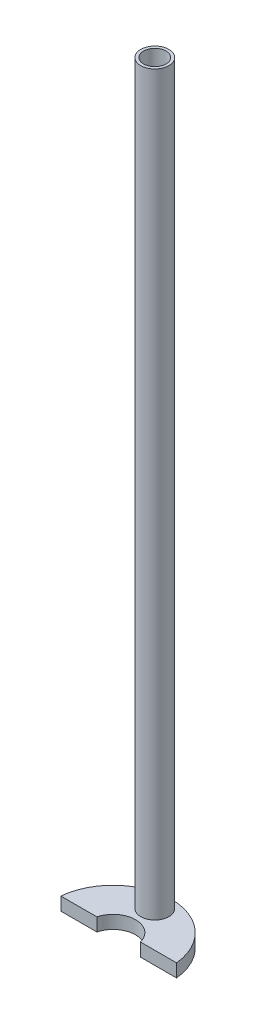
ISO-10303-21;
HEADER;
FILE_DESCRIPTION(('STEP AP214'),'2;1');
FILE_NAME('part.step','',(''),(''),'','','');
FILE_SCHEMA(('AUTOMOTIVE_DESIGN { 1 0 10303 214 1 1 1 1 }'));
ENDSEC;
DATA;
#1=APPLICATION_CONTEXT('core data for automotive mechanical design processes');
#2=APPLICATION_PROTOCOL_DEFINITION('international standard','automotive_design',2000,#1);
#3=PRODUCT_CONTEXT('',#1,'mechanical');
#4=PRODUCT('Part','Part','',(#3));
#5=PRODUCT_RELATED_PRODUCT_CATEGORY('part','',(#4));
#6=PRODUCT_DEFINITION_FORMATION('','',#4);
#7=PRODUCT_DEFINITION_CONTEXT('part definition',#1,'design');
#8=PRODUCT_DEFINITION('design','',#6,#7);
#9=PRODUCT_DEFINITION_SHAPE('','',#8);
#10=(LENGTH_UNIT() NAMED_UNIT(*) SI_UNIT(.MILLI.,.METRE.));
#11=(NAMED_UNIT(*) PLANE_ANGLE_UNIT() SI_UNIT($,.RADIAN.));
#12=(NAMED_UNIT(*) SI_UNIT($,.STERADIAN.) SOLID_ANGLE_UNIT());
#13=UNCERTAINTY_MEASURE_WITH_UNIT(LENGTH_MEASURE(1.E-05),#10,'distance_accuracy_value','');
#14=(GEOMETRIC_REPRESENTATION_CONTEXT(3) GLOBAL_UNCERTAINTY_ASSIGNED_CONTEXT((#13)) GLOBAL_UNIT_ASSIGNED_CONTEXT((#10,
#11,#12)) REPRESENTATION_CONTEXT('',''));
#15=CARTESIAN_POINT('',(0.,0.,0.));
#16=DIRECTION('',(0.,0.,1.));
#17=DIRECTION('',(1.,0.,0.));
#18=AXIS2_PLACEMENT_3D('',#15,#16,#17);
#19=CARTESIAN_POINT('',(0.,3.5,0.));
#20=DIRECTION('',(0.,-1.,0.));
#21=DIRECTION('',(0.,0.,-1.));
#22=AXIS2_PLACEMENT_3D('',#19,#20,#21);
#23=CYLINDRICAL_SURFACE('',#22,6.);
#24=CARTESIAN_POINT('',(0.,0.,0.));
#25=DIRECTION('',(0.,1.,0.));
#26=DIRECTION('',(0.,0.,1.));
#27=AXIS2_PLACEMENT_3D('',#24,#25,#26);
#28=CIRCLE('',#27,6.);
#29=CARTESIAN_POINT('',(5.80947501931112,0.,-1.5));
#30=VERTEX_POINT('',#29);
#31=CARTESIAN_POINT('',(-5.80947501931112,0.,-1.5));
#32=VERTEX_POINT('',#31);
#33=EDGE_CURVE('E113',#30,#32,#28,.T.);
#34=ORIENTED_EDGE('',*,*,#33,.F.);
#35=DIRECTION('',(0.,-1.,0.));
#36=VECTOR('',#35,1.);
#37=CARTESIAN_POINT('',(5.80947501931112,3.5,-1.5));
#38=LINE('',#37,#36);
#39=CARTESIAN_POINT('',(5.80947501931112,3.5,-1.5));
#40=VERTEX_POINT('',#39);
#41=EDGE_CURVE('E11',#40,#30,#38,.T.);
#42=ORIENTED_EDGE('',*,*,#41,.F.);
#43=CARTESIAN_POINT('',(0.,3.5,0.));
#44=DIRECTION('',(0.,1.,0.));
#45=DIRECTION('',(0.,0.,1.));
#46=AXIS2_PLACEMENT_3D('',#43,#44,#45);
#47=CIRCLE('',#46,6.);
#48=CARTESIAN_POINT('',(-5.80947501931112,3.5,-1.5));
#49=VERTEX_POINT('',#48);
#50=EDGE_CURVE('E98',#40,#49,#47,.T.);
#51=ORIENTED_EDGE('',*,*,#50,.T.);
#52=DIRECTION('',(0.,-1.,0.));
#53=VECTOR('',#52,1.);
#54=CARTESIAN_POINT('',(-5.80947501931112,3.5,-1.5));
#55=LINE('',#54,#53);
#56=EDGE_CURVE('E87',#49,#32,#55,.T.);
#57=ORIENTED_EDGE('',*,*,#56,.T.);
#58=EDGE_LOOP('',(#34,#42,#51,#57));
#59=FACE_BOUND('',#58,.T.);
#60=ADVANCED_FACE('F47',(#59),#23,.F.);
#61=CARTESIAN_POINT('',(0.,3.5,-1.5));
#62=DIRECTION('',(0.,0.,-1.));
#63=DIRECTION('',(-1.,0.,0.));
#64=AXIS2_PLACEMENT_3D('',#61,#62,#63);
#65=PLANE('',#64);
#66=DIRECTION('',(1.,0.,0.));
#67=VECTOR('',#66,1.);
#68=CARTESIAN_POINT('',(0.,0.,-1.5));
#69=LINE('',#68,#67);
#70=CARTESIAN_POINT('',(15.4272486205415,0.,-1.5));
#71=VERTEX_POINT('',#70);
#72=EDGE_CURVE('E104',#30,#71,#69,.T.);
#73=ORIENTED_EDGE('',*,*,#72,.T.);
#74=DIRECTION('',(0.,-1.,0.));
#75=VECTOR('',#74,1.);
#76=CARTESIAN_POINT('',(15.4272486205415,3.5,-1.5));
#77=LINE('',#76,#75);
#78=CARTESIAN_POINT('',(15.4272486205415,3.5,-1.5));
#79=VERTEX_POINT('',#78);
#80=EDGE_CURVE('E56',#79,#71,#77,.T.);
#81=ORIENTED_EDGE('',*,*,#80,.F.);
#82=DIRECTION('',(1.,0.,0.));
#83=VECTOR('',#82,1.);
#84=CARTESIAN_POINT('',(0.,3.5,-1.5));
#85=LINE('',#84,#83);
#86=EDGE_CURVE('E93',#40,#79,#85,.T.);
#87=ORIENTED_EDGE('',*,*,#86,.F.);
#88=ORIENTED_EDGE('',*,*,#41,.T.);
#89=EDGE_LOOP('',(#73,#81,#87,#88));
#90=FACE_BOUND('',#89,.T.);
#91=ADVANCED_FACE('F102',(#90),#65,.F.);
#92=CARTESIAN_POINT('',(0.,3.5,0.));
#93=DIRECTION('',(0.,-1.,0.));
#94=DIRECTION('',(0.,0.,-1.));
#95=AXIS2_PLACEMENT_3D('',#92,#93,#94);
#96=CYLINDRICAL_SURFACE('',#95,15.5);
#97=CARTESIAN_POINT('',(0.,0.,0.));
#98=DIRECTION('',(0.,1.,0.));
#99=DIRECTION('',(0.,0.,1.));
#100=AXIS2_PLACEMENT_3D('',#97,#98,#99);
#101=CIRCLE('',#100,15.5);
#102=CARTESIAN_POINT('',(-15.4272486205415,0.,-1.5));
#103=VERTEX_POINT('',#102);
#104=EDGE_CURVE('E80',#71,#103,#101,.T.);
#105=ORIENTED_EDGE('',*,*,#104,.T.);
#106=DIRECTION('',(0.,-1.,0.));
#107=VECTOR('',#106,1.);
#108=CARTESIAN_POINT('',(-15.4272486205415,3.5,-1.5));
#109=LINE('',#108,#107);
#110=CARTESIAN_POINT('',(-15.4272486205415,3.5,-1.5));
#111=VERTEX_POINT('',#110);
#112=EDGE_CURVE('E106',#111,#103,#109,.T.);
#113=ORIENTED_EDGE('',*,*,#112,.F.);
#114=CARTESIAN_POINT('',(0.,3.5,0.));
#115=DIRECTION('',(0.,1.,0.));
#116=DIRECTION('',(0.,0.,1.));
#117=AXIS2_PLACEMENT_3D('',#114,#115,#116);
#118=CIRCLE('',#117,15.5);
#119=EDGE_CURVE('E97',#79,#111,#118,.T.);
#120=ORIENTED_EDGE('',*,*,#119,.F.);
#121=ORIENTED_EDGE('',*,*,#80,.T.);
#122=EDGE_LOOP('',(#105,#113,#120,#121));
#123=FACE_BOUND('',#122,.T.);
#124=ADVANCED_FACE('F107',(#123),#96,.T.);
#125=EDGE_CURVE('E120',#103,#32,#69,.T.);
#126=ORIENTED_EDGE('',*,*,#125,.T.);
#127=ORIENTED_EDGE('',*,*,#56,.F.);
#128=EDGE_CURVE('E64',#111,#49,#85,.T.);
#129=ORIENTED_EDGE('',*,*,#128,.F.);
#130=ORIENTED_EDGE('',*,*,#112,.T.);
#131=EDGE_LOOP('',(#126,#127,#129,#130));
#132=FACE_BOUND('',#131,.T.);
#133=ADVANCED_FACE('F128',(#132),#65,.F.);
#134=CARTESIAN_POINT('',(0.,3.5,0.));
#135=DIRECTION('',(0.,1.,0.));
#136=DIRECTION('',(0.,0.,1.));
#137=AXIS2_PLACEMENT_3D('',#134,#135,#136);
#138=PLANE('',#137);
#139=CARTESIAN_POINT('',(0.,3.5,-11.125));
#140=DIRECTION('',(0.,1.,0.));
#141=DIRECTION('',(0.,0.,1.));
#142=AXIS2_PLACEMENT_3D('',#139,#140,#141);
#143=CIRCLE('',#142,3.75);
#144=CARTESIAN_POINT('',(0.,3.5,-7.375));
#145=VERTEX_POINT('',#144);
#146=EDGE_CURVE('E117',#145,#145,#143,.F.);
#147=ORIENTED_EDGE('',*,*,#146,.T.);
#148=EDGE_LOOP('',(#147));
#149=FACE_BOUND('',#148,.T.);
#150=ORIENTED_EDGE('',*,*,#50,.F.);
#151=ORIENTED_EDGE('',*,*,#86,.T.);
#152=ORIENTED_EDGE('',*,*,#119,.T.);
#153=ORIENTED_EDGE('',*,*,#128,.T.);
#154=EDGE_LOOP('',(#150,#151,#152,#153));
#155=FACE_BOUND('',#154,.T.);
#156=ADVANCED_FACE('F95',(#149,#155),#138,.T.);
#157=CARTESIAN_POINT('',(0.,0.,0.));
#158=DIRECTION('',(0.,1.,0.));
#159=DIRECTION('',(0.,0.,1.));
#160=AXIS2_PLACEMENT_3D('',#157,#158,#159);
#161=PLANE('',#160);
#162=CARTESIAN_POINT('',(0.,0.,-11.125));
#163=DIRECTION('',(0.,1.,0.));
#164=DIRECTION('',(0.,0.,1.));
#165=AXIS2_PLACEMENT_3D('',#162,#163,#164);
#166=CIRCLE('',#165,3.);
#167=CARTESIAN_POINT('',(0.,0.,-8.125));
#168=VERTEX_POINT('',#167);
#169=EDGE_CURVE('E141',#168,#168,#166,.T.);
#170=ORIENTED_EDGE('',*,*,#169,.T.);
#171=EDGE_LOOP('',(#170));
#172=FACE_BOUND('',#171,.T.);
#173=ORIENTED_EDGE('',*,*,#33,.T.);
#174=ORIENTED_EDGE('',*,*,#125,.F.);
#175=ORIENTED_EDGE('',*,*,#104,.F.);
#176=ORIENTED_EDGE('',*,*,#72,.F.);
#177=EDGE_LOOP('',(#173,#174,#175,#176));
#178=FACE_BOUND('',#177,.T.);
#179=ADVANCED_FACE('F130',(#172,#178),#161,.F.);
#180=CARTESIAN_POINT('',(0.,200.,-11.125));
#181=DIRECTION('',(0.,-1.,0.));
#182=DIRECTION('',(0.,0.,-1.));
#183=AXIS2_PLACEMENT_3D('',#180,#181,#182);
#184=CYLINDRICAL_SURFACE('',#183,3.75);
#185=ORIENTED_EDGE('',*,*,#146,.F.);
#186=EDGE_LOOP('',(#185));
#187=FACE_BOUND('',#186,.T.);
#188=CARTESIAN_POINT('',(0.,200.,-11.125));
#189=DIRECTION('',(0.,1.,0.));
#190=DIRECTION('',(0.,0.,1.));
#191=AXIS2_PLACEMENT_3D('',#188,#189,#190);
#192=CIRCLE('',#191,3.75);
#193=CARTESIAN_POINT('',(0.,200.,-7.375));
#194=VERTEX_POINT('',#193);
#195=EDGE_CURVE('E137',#194,#194,#192,.T.);
#196=ORIENTED_EDGE('',*,*,#195,.F.);
#197=EDGE_LOOP('',(#196));
#198=FACE_BOUND('',#197,.T.);
#199=ADVANCED_FACE('F160',(#187,#198),#184,.T.);
#200=CARTESIAN_POINT('',(0.,200.,-11.125));
#201=DIRECTION('',(0.,1.,0.));
#202=DIRECTION('',(0.,0.,1.));
#203=AXIS2_PLACEMENT_3D('',#200,#201,#202);
#204=PLANE('',#203);
#205=CARTESIAN_POINT('',(0.,200.,-11.125));
#206=DIRECTION('',(0.,1.,0.));
#207=DIRECTION('',(0.,0.,1.));
#208=AXIS2_PLACEMENT_3D('',#205,#206,#207);
#209=CIRCLE('',#208,3.);
#210=CARTESIAN_POINT('',(0.,200.,-8.125));
#211=VERTEX_POINT('',#210);
#212=EDGE_CURVE('E142',#211,#211,#209,.T.);
#213=ORIENTED_EDGE('',*,*,#212,.F.);
#214=EDGE_LOOP('',(#213));
#215=FACE_BOUND('',#214,.T.);
#216=ORIENTED_EDGE('',*,*,#195,.T.);
#217=EDGE_LOOP('',(#216));
#218=FACE_BOUND('',#217,.T.);
#219=ADVANCED_FACE('F154',(#215,#218),#204,.T.);
#220=CARTESIAN_POINT('',(0.,0.,-11.125));
#221=DIRECTION('',(0.,1.,0.));
#222=DIRECTION('',(0.,0.,1.));
#223=AXIS2_PLACEMENT_3D('',#220,#221,#222);
#224=CYLINDRICAL_SURFACE('',#223,3.);
#225=ORIENTED_EDGE('',*,*,#169,.F.);
#226=EDGE_LOOP('',(#225));
#227=FACE_BOUND('',#226,.T.);
#228=ORIENTED_EDGE('',*,*,#212,.T.);
#229=EDGE_LOOP('',(#228));
#230=FACE_BOUND('',#229,.T.);
#231=ADVANCED_FACE('F151',(#227,#230),#224,.F.);
#232=CLOSED_SHELL('',(#60,#91,#124,#133,#156,#179,#199,#219,#231));
#233=MANIFOLD_SOLID_BREP('B2',#232);
#234=ADVANCED_BREP_SHAPE_REPRESENTATION('',(#18,#233),#14);
#235=SHAPE_DEFINITION_REPRESENTATION(#9,#234);
ENDSEC;
END-ISO-10303-21;
